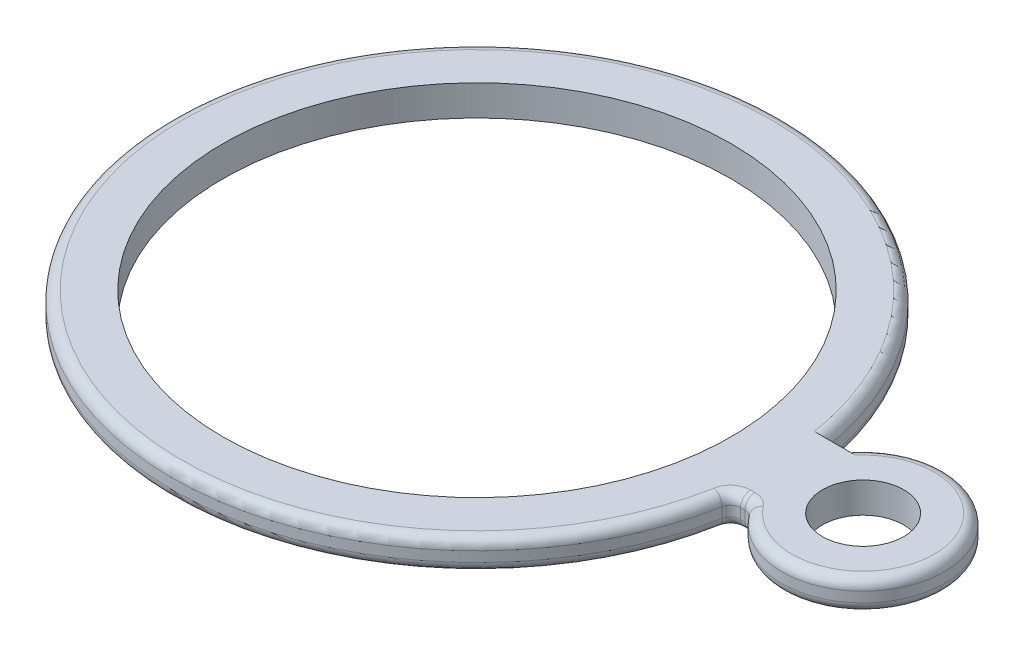
ISO-10303-21;
HEADER;
FILE_DESCRIPTION(('STEP AP214'),'2;1');
FILE_NAME('part.step','',(''),(''),'','','');
FILE_SCHEMA(('AUTOMOTIVE_DESIGN { 1 0 10303 214 1 1 1 1 }'));
ENDSEC;
DATA;
#1=APPLICATION_CONTEXT('core data for automotive mechanical design processes');
#2=APPLICATION_PROTOCOL_DEFINITION('international standard','automotive_design',2000,#1);
#3=PRODUCT_CONTEXT('',#1,'mechanical');
#4=PRODUCT('Part','Part','',(#3));
#5=PRODUCT_RELATED_PRODUCT_CATEGORY('part','',(#4));
#6=PRODUCT_DEFINITION_FORMATION('','',#4);
#7=PRODUCT_DEFINITION_CONTEXT('part definition',#1,'design');
#8=PRODUCT_DEFINITION('design','',#6,#7);
#9=PRODUCT_DEFINITION_SHAPE('','',#8);
#10=(LENGTH_UNIT() NAMED_UNIT(*) SI_UNIT(.MILLI.,.METRE.));
#11=(NAMED_UNIT(*) PLANE_ANGLE_UNIT() SI_UNIT($,.RADIAN.));
#12=(NAMED_UNIT(*) SI_UNIT($,.STERADIAN.) SOLID_ANGLE_UNIT());
#13=UNCERTAINTY_MEASURE_WITH_UNIT(LENGTH_MEASURE(1.E-05),#10,'distance_accuracy_value','');
#14=(GEOMETRIC_REPRESENTATION_CONTEXT(3) GLOBAL_UNCERTAINTY_ASSIGNED_CONTEXT((#13)) GLOBAL_UNIT_ASSIGNED_CONTEXT((#10,
#11,#12)) REPRESENTATION_CONTEXT('',''));
#15=CARTESIAN_POINT('',(0.,0.,0.));
#16=DIRECTION('',(0.,0.,1.));
#17=DIRECTION('',(1.,0.,0.));
#18=AXIS2_PLACEMENT_3D('',#15,#16,#17);
#19=CARTESIAN_POINT('',(0.,3.,0.));
#20=DIRECTION('',(0.,-1.,0.));
#21=DIRECTION('',(0.,0.,-1.));
#22=AXIS2_PLACEMENT_3D('',#19,#20,#21);
#23=CYLINDRICAL_SURFACE('',#22,30.);
#24=DIRECTION('',(0.,-1.,0.));
#25=VECTOR('',#24,1.);
#26=CARTESIAN_POINT('',(29.5132295758515,3.,5.3823117712637));
#27=LINE('',#26,#25);
#28=CARTESIAN_POINT('',(29.5132295758515,1.,5.3823117712637));
#29=VERTEX_POINT('',#28);
#30=CARTESIAN_POINT('',(29.5132295758515,2.,5.3823117712637));
#31=VERTEX_POINT('',#30);
#32=EDGE_CURVE('E193',#29,#31,#27,.F.);
#33=ORIENTED_EDGE('',*,*,#32,.T.);
#34=CARTESIAN_POINT('',(0.,2.,0.));
#35=DIRECTION('',(0.,1.,0.));
#36=DIRECTION('',(0.,0.,1.));
#37=AXIS2_PLACEMENT_3D('',#34,#35,#36);
#38=CIRCLE('',#37,30.);
#39=CARTESIAN_POINT('',(29.6511499085915,2.,-4.56172216363916));
#40=VERTEX_POINT('',#39);
#41=EDGE_CURVE('E197',#31,#40,#38,.F.);
#42=ORIENTED_EDGE('',*,*,#41,.T.);
#43=DIRECTION('',(0.,-1.,0.));
#44=VECTOR('',#43,1.);
#45=CARTESIAN_POINT('',(29.6511499085915,3.,-4.56172216363916));
#46=LINE('',#45,#44);
#47=CARTESIAN_POINT('',(29.6511499085915,1.,-4.56172216363916));
#48=VERTEX_POINT('',#47);
#49=EDGE_CURVE('E182',#40,#48,#46,.T.);
#50=ORIENTED_EDGE('',*,*,#49,.T.);
#51=CARTESIAN_POINT('',(0.,1.,0.));
#52=DIRECTION('',(0.,1.,0.));
#53=DIRECTION('',(0.,0.,1.));
#54=AXIS2_PLACEMENT_3D('',#51,#52,#53);
#55=CIRCLE('',#54,30.);
#56=EDGE_CURVE('E195',#48,#29,#55,.T.);
#57=ORIENTED_EDGE('',*,*,#56,.T.);
#58=EDGE_LOOP('',(#33,#42,#50,#57));
#59=FACE_BOUND('',#58,.T.);
#60=ADVANCED_FACE('F35',(#59),#23,.T.);
#61=CARTESIAN_POINT('',(0.,3.,4.56172216363916));
#62=DIRECTION('',(0.,0.,-1.));
#63=DIRECTION('',(-1.,0.,0.));
#64=AXIS2_PLACEMENT_3D('',#61,#62,#63);
#65=PLANE('',#64);
#66=DIRECTION('',(1.,0.,0.));
#67=VECTOR('',#66,1.);
#68=CARTESIAN_POINT('',(29.6511499085915,2.,4.56172216363916));
#69=LINE('',#68,#67);
#70=CARTESIAN_POINT('',(30.9241787349817,2.,4.56172216363916));
#71=VERTEX_POINT('',#70);
#72=CARTESIAN_POINT('',(30.4970038950466,2.,4.56172216363916));
#73=VERTEX_POINT('',#72);
#74=EDGE_CURVE('E53',#71,#73,#69,.F.);
#75=ORIENTED_EDGE('',*,*,#74,.T.);
#76=DIRECTION('',(0.,1.,0.));
#77=VECTOR('',#76,1.);
#78=CARTESIAN_POINT('',(30.4970038950466,0.,4.56172216363916));
#79=LINE('',#78,#77);
#80=CARTESIAN_POINT('',(30.4970038950466,1.,4.56172216363916));
#81=VERTEX_POINT('',#80);
#82=EDGE_CURVE('E220',#73,#81,#79,.F.);
#83=ORIENTED_EDGE('',*,*,#82,.T.);
#84=DIRECTION('',(1.,0.,0.));
#85=VECTOR('',#84,1.);
#86=CARTESIAN_POINT('',(0.,1.,4.56172216363916));
#87=LINE('',#86,#85);
#88=CARTESIAN_POINT('',(30.9241787349817,1.,4.56172216363916));
#89=VERTEX_POINT('',#88);
#90=EDGE_CURVE('E216',#81,#89,#87,.T.);
#91=ORIENTED_EDGE('',*,*,#90,.T.);
#92=DIRECTION('',(0.,1.,0.));
#93=VECTOR('',#92,1.);
#94=CARTESIAN_POINT('',(30.9241787349817,3.,4.56172216363916));
#95=LINE('',#94,#93);
#96=EDGE_CURVE('E58',#89,#71,#95,.T.);
#97=ORIENTED_EDGE('',*,*,#96,.T.);
#98=EDGE_LOOP('',(#75,#83,#91,#97));
#99=FACE_BOUND('',#98,.T.);
#100=ADVANCED_FACE('F279',(#99),#65,.F.);
#101=CARTESIAN_POINT('',(38.,3.,0.));
#102=DIRECTION('',(0.,-1.,0.));
#103=DIRECTION('',(0.,0.,-1.));
#104=AXIS2_PLACEMENT_3D('',#101,#102,#103);
#105=CYLINDRICAL_SURFACE('',#104,8.);
#106=DIRECTION('',(0.,-1.,0.));
#107=VECTOR('',#106,1.);
#108=CARTESIAN_POINT('',(31.428037515189,3.,-4.56172216363916));
#109=LINE('',#108,#107);
#110=CARTESIAN_POINT('',(31.428037515189,2.,-4.56172216363916));
#111=VERTEX_POINT('',#110);
#112=CARTESIAN_POINT('',(31.428037515189,1.,-4.56172216363916));
#113=VERTEX_POINT('',#112);
#114=EDGE_CURVE('E139',#111,#113,#109,.T.);
#115=ORIENTED_EDGE('',*,*,#114,.F.);
#116=CARTESIAN_POINT('',(38.,2.,0.));
#117=DIRECTION('',(0.,1.,0.));
#118=DIRECTION('',(0.,0.,1.));
#119=AXIS2_PLACEMENT_3D('',#116,#117,#118);
#120=CIRCLE('',#119,8.);
#121=CARTESIAN_POINT('',(31.7103810977615,2.,4.94375303434592));
#122=VERTEX_POINT('',#121);
#123=EDGE_CURVE('E214',#111,#122,#120,.F.);
#124=ORIENTED_EDGE('',*,*,#123,.T.);
#125=DIRECTION('',(0.,-1.,0.));
#126=VECTOR('',#125,1.);
#127=CARTESIAN_POINT('',(31.7103810977615,3.,4.94375303434592));
#128=LINE('',#127,#126);
#129=CARTESIAN_POINT('',(31.7103810977615,1.,4.94375303434592));
#130=VERTEX_POINT('',#129);
#131=EDGE_CURVE('E210',#122,#130,#128,.T.);
#132=ORIENTED_EDGE('',*,*,#131,.T.);
#133=CARTESIAN_POINT('',(38.,1.,0.));
#134=DIRECTION('',(0.,1.,0.));
#135=DIRECTION('',(0.,0.,1.));
#136=AXIS2_PLACEMENT_3D('',#133,#134,#135);
#137=CIRCLE('',#136,8.);
#138=EDGE_CURVE('E212',#130,#113,#137,.T.);
#139=ORIENTED_EDGE('',*,*,#138,.T.);
#140=EDGE_LOOP('',(#115,#124,#132,#139));
#141=FACE_BOUND('',#140,.T.);
#142=ADVANCED_FACE('F251',(#141),#105,.T.);
#143=CARTESIAN_POINT('',(0.,3.,0.));
#144=DIRECTION('',(0.,-1.,0.));
#145=DIRECTION('',(0.,0.,-1.));
#146=AXIS2_PLACEMENT_3D('',#143,#144,#145);
#147=CYLINDRICAL_SURFACE('',#146,25.);
#148=CARTESIAN_POINT('',(0.,3.,0.));
#149=DIRECTION('',(0.,1.,0.));
#150=DIRECTION('',(0.,0.,1.));
#151=AXIS2_PLACEMENT_3D('',#148,#149,#150);
#152=CIRCLE('',#151,25.);
#153=CARTESIAN_POINT('',(0.,3.,25.));
#154=VERTEX_POINT('',#153);
#155=EDGE_CURVE('E426',#154,#154,#152,.T.);
#156=ORIENTED_EDGE('',*,*,#155,.T.);
#157=EDGE_LOOP('',(#156));
#158=FACE_BOUND('',#157,.T.);
#159=CARTESIAN_POINT('',(0.,0.,0.));
#160=DIRECTION('',(0.,1.,0.));
#161=DIRECTION('',(0.,0.,1.));
#162=AXIS2_PLACEMENT_3D('',#159,#160,#161);
#163=CIRCLE('',#162,25.);
#164=CARTESIAN_POINT('',(0.,0.,25.));
#165=VERTEX_POINT('',#164);
#166=EDGE_CURVE('E168',#165,#165,#163,.T.);
#167=ORIENTED_EDGE('',*,*,#166,.F.);
#168=EDGE_LOOP('',(#167));
#169=FACE_BOUND('',#168,.T.);
#170=ADVANCED_FACE('F248',(#158,#169),#147,.F.);
#171=CARTESIAN_POINT('',(0.,3.,-4.56172216363916));
#172=DIRECTION('',(0.,0.,-1.));
#173=DIRECTION('',(-1.,0.,0.));
#174=AXIS2_PLACEMENT_3D('',#171,#172,#173);
#175=PLANE('',#174);
#176=DIRECTION('',(1.,0.,0.));
#177=VECTOR('',#176,1.);
#178=CARTESIAN_POINT('',(0.,0.,-4.56172216363916));
#179=LINE('',#178,#177);
#180=CARTESIAN_POINT('',(28.6389715405732,0.,-4.56172216363916));
#181=VERTEX_POINT('',#180);
#182=CARTESIAN_POINT('',(32.6905093557138,0.,-4.56172216363916));
#183=VERTEX_POINT('',#182);
#184=EDGE_CURVE('E164',#181,#183,#179,.T.);
#185=ORIENTED_EDGE('',*,*,#184,.F.);
#186=CARTESIAN_POINT('',(28.6389715405732,0.,-4.56172216363916));
#187=CARTESIAN_POINT('',(28.6964328075229,-4.55510179670688E-05,-4.56172216363916));
#188=CARTESIAN_POINT('',(28.7538845778944,0.00482756519208188,-4.56172216363916));
#189=CARTESIAN_POINT('',(28.8671486516525,0.0240852129021317,-4.56172216363916));
#190=CARTESIAN_POINT('',(28.9229616110344,0.038465882909663,-4.56172216363916));
#191=CARTESIAN_POINT('',(29.0314104884211,0.0764249878051002,-4.56172216363916));
#192=CARTESIAN_POINT('',(29.0840444121535,0.10000912841061,-4.56172216363916));
#193=CARTESIAN_POINT('',(29.1845597541203,0.155722746068513,-4.56172216363916));
#194=CARTESIAN_POINT('',(29.2324425277727,0.187849776307178,-4.56172216363916));
#195=CARTESIAN_POINT('',(29.3217842791457,0.259556471933176,-4.56172216363916));
#196=CARTESIAN_POINT('',(29.36328028255,0.299089987846407,-4.56172216363916));
#197=CARTESIAN_POINT('',(29.438960770142,0.384645486723418,-4.56172216363916));
#198=CARTESIAN_POINT('',(29.4731439946626,0.430668585292413,-4.56172216363916));
#199=CARTESIAN_POINT('',(29.5328006308723,0.527322351135234,-4.56172216363916));
#200=CARTESIAN_POINT('',(29.5583684869613,0.577894799683099,-4.56172216363916));
#201=CARTESIAN_POINT('',(29.6005332524671,0.682632366302645,-4.56172216363916));
#202=CARTESIAN_POINT('',(29.6171369388897,0.736794735475624,-4.56172216363916));
#203=CARTESIAN_POINT('',(29.6363673626402,0.826124464892985,-4.56172216363916));
#204=CARTESIAN_POINT('',(29.6419076185208,0.860691323328164,-4.56172216363916));
#205=CARTESIAN_POINT('',(29.6492980369049,0.930166880125294,-4.56172216363916));
#206=CARTESIAN_POINT('',(29.6511534942957,0.965075015443822,-4.56172216363916));
#207=CARTESIAN_POINT('',(29.6511499085915,1.,-4.56172216363916));
#208=B_SPLINE_CURVE_WITH_KNOTS('',3,(#186,#187,#188,#189,#190,#191,#192,#193,#194,#195,#196,
#197,#198,#199,#200,#201,#202,#203,#204,#205,#206,#207),.UNSPECIFIED.,.F.,.F.,(4,2,2,2,2,2,2,2,
2,2,4),(0.,0.172164747896742,0.344259614011329,0.516461340753014,0.688613799322514,
0.859727258187154,1.03087016861033,1.20007078835339,1.3691433108975,1.47398689604088,
1.57867971640918),.UNSPECIFIED.);
#209=EDGE_CURVE('E231',#181,#48,#208,.T.);
#210=ORIENTED_EDGE('',*,*,#209,.T.);
#211=ORIENTED_EDGE('',*,*,#49,.F.);
#212=CARTESIAN_POINT('',(29.6511499085915,2.,-4.56172216363916));
#213=CARTESIAN_POINT('',(29.6511498894436,2.02789484300134,-4.56172216363916));
#214=CARTESIAN_POINT('',(29.6499682378599,2.05577624136621,-4.56172216363916));
#215=CARTESIAN_POINT('',(29.645255284375,2.11133774042069,-4.56172216363916));
#216=CARTESIAN_POINT('',(29.6417241482003,2.13901785516908,-4.56172216363916));
#217=CARTESIAN_POINT('',(29.6276451695433,2.22139243707681,-4.56172216363916));
#218=CARTESIAN_POINT('',(29.6136116323102,2.27553224261742,-4.56172216363916));
#219=CARTESIAN_POINT('',(29.576664431473,2.38068121473864,-4.56172216363916));
#220=CARTESIAN_POINT('',(29.5537474848748,2.43168921583259,-4.56172216363916));
#221=CARTESIAN_POINT('',(29.4997178856042,2.5291618156753,-4.56172216363916));
#222=CARTESIAN_POINT('',(29.4686059360899,2.5756268037607,-4.56172216363916));
#223=CARTESIAN_POINT('',(29.3989238263734,2.66295626432184,-4.56172216363916));
#224=CARTESIAN_POINT('',(29.360317257298,2.70379166115939,-4.56172216363916));
#225=CARTESIAN_POINT('',(29.2768554758536,2.77849521243116,-4.56172216363916));
#226=CARTESIAN_POINT('',(29.2319989373799,2.81236188446963,-4.56172216363916));
#227=CARTESIAN_POINT('',(29.1367854631797,2.87256299902535,-4.56172216363916));
#228=CARTESIAN_POINT('',(29.0863724566466,2.89880866047738,-4.56172216363916));
#229=CARTESIAN_POINT('',(28.9818962593331,2.94255912820593,-4.56172216363916));
#230=CARTESIAN_POINT('',(28.9278345701572,2.96006750568296,-4.56172216363916));
#231=CARTESIAN_POINT('',(28.834424610554,2.9819632081696,-4.56172216363916));
#232=CARTESIAN_POINT('',(28.7956149284715,2.98872334815358,-4.56172216363916));
#233=CARTESIAN_POINT('',(28.717532115619,2.99774146814459,-4.56172216363916));
#234=CARTESIAN_POINT('',(28.6782597245563,3.0000058537892,-4.56172216363916));
#235=CARTESIAN_POINT('',(28.6389715405732,3.,-4.56172216363916));
#236=B_SPLINE_CURVE_WITH_KNOTS('',3,(#212,#213,#214,#215,#216,#217,#218,#219,#220,#221,#222,
#223,#224,#225,#226,#227,#228,#229,#230,#231,#232,#233,#234,#235),.UNSPECIFIED.,.F.,.F.,(4,2,2,
2,2,2,2,2,2,2,2,4),(0.,0.0836328495791446,0.167259800547139,0.334184665223513,0.501171278332986,
0.668143568107361,0.835948280900832,1.00378865250293,1.1735123151024,1.34316654941164,
1.46110326311434,1.57887181737315),.UNSPECIFIED.);
#237=CARTESIAN_POINT('',(28.6389715405732,3.,-4.56172216363916));
#238=VERTEX_POINT('',#237);
#239=EDGE_CURVE('E222',#40,#238,#236,.T.);
#240=ORIENTED_EDGE('',*,*,#239,.T.);
#241=DIRECTION('',(1.,0.,0.));
#242=VECTOR('',#241,1.);
#243=CARTESIAN_POINT('',(0.,3.,-4.56172216363916));
#244=LINE('',#243,#242);
#245=CARTESIAN_POINT('',(32.6905093557138,3.,-4.56172216363916));
#246=VERTEX_POINT('',#245);
#247=EDGE_CURVE('E181',#238,#246,#244,.T.);
#248=ORIENTED_EDGE('',*,*,#247,.T.);
#249=CARTESIAN_POINT('',(32.6905093557138,3.,-4.56172216363916));
#250=CARTESIAN_POINT('',(32.6062895909377,2.99999226976471,-4.56172216363916));
#251=CARTESIAN_POINT('',(32.5218199849481,2.9938694477852,-4.56172216363916));
#252=CARTESIAN_POINT('',(32.3542842919586,2.96838243353989,-4.56172216363916));
#253=CARTESIAN_POINT('',(32.271233579335,2.94891880046482,-4.56172216363916));
#254=CARTESIAN_POINT('',(32.124024199513,2.9004033311119,-4.56172216363916));
#255=CARTESIAN_POINT('',(32.0591171728084,2.87364836321297,-4.56172216363916));
#256=CARTESIAN_POINT('',(31.934588817064,2.81006589663255,-4.56172216363916));
#257=CARTESIAN_POINT('',(31.8749515744507,2.77327019805864,-4.56172216363916));
#258=CARTESIAN_POINT('',(31.7732274843745,2.69695575281444,-4.56172216363916));
#259=CARTESIAN_POINT('',(31.7299061341197,2.65908720454119,-4.56172216363916));
#260=CARTESIAN_POINT('',(31.6500164590252,2.57669576233968,-4.56172216363916));
#261=CARTESIAN_POINT('',(31.6134499665493,2.53217106873383,-4.56172216363916));
#262=CARTESIAN_POINT('',(31.5486420430787,2.43684231395269,-4.56172216363916));
#263=CARTESIAN_POINT('',(31.5204708271419,2.38599007261506,-4.56172216363916));
#264=CARTESIAN_POINT('',(31.4746899001138,2.2797662090897,-4.56172216363916));
#265=CARTESIAN_POINT('',(31.4570571840414,2.22440473296227,-4.56172216363916));
#266=CARTESIAN_POINT('',(31.4395919769499,2.14028446304133,-4.56172216363916));
#267=CARTESIAN_POINT('',(31.435267941393,2.11240063949711,-4.56172216363916));
#268=CARTESIAN_POINT('',(31.4294897887883,2.05635143766009,-4.56172216363916));
#269=CARTESIAN_POINT('',(31.4280342685707,2.02818620380286,-4.56172216363916));
#270=CARTESIAN_POINT('',(31.428037515189,2.,-4.56172216363916));
#271=B_SPLINE_CURVE_WITH_KNOTS('',3,(#249,#250,#251,#252,#253,#254,#255,#256,#257,#258,#259,
#260,#261,#262,#263,#264,#265,#266,#267,#268,#269,#270),.UNSPECIFIED.,.F.,.F.,(4,2,2,2,2,2,2,2,
2,2,4),(0.,0.252844612339547,0.507594691786583,0.717409020923558,0.926566406429637,
1.09849825985415,1.27047668428913,1.44385551775163,1.61685447886156,1.70137660043909,
1.78585736670053),.UNSPECIFIED.);
#272=EDGE_CURVE('E45',#246,#111,#271,.T.);
#273=ORIENTED_EDGE('',*,*,#272,.T.);
#274=ORIENTED_EDGE('',*,*,#114,.T.);
#275=CARTESIAN_POINT('',(31.428037515189,1.,-4.56172216363916));
#276=CARTESIAN_POINT('',(31.4280354834646,0.975571890815246,-4.56172216363916));
#277=CARTESIAN_POINT('',(31.4291279741013,0.951156885585626,-4.56172216363916));
#278=CARTESIAN_POINT('',(31.4334712243956,0.902528919942106,-4.56172216363916));
#279=CARTESIAN_POINT('',(31.4367211476929,0.878315884913179,-4.56172216363916));
#280=CARTESIAN_POINT('',(31.4496120548973,0.806494346106857,-4.56172216363916));
#281=CARTESIAN_POINT('',(31.4623950017396,0.759415565707707,-4.56172216363916));
#282=CARTESIAN_POINT('',(31.4956529751019,0.668171427016443,-4.56172216363916));
#283=CARTESIAN_POINT('',(31.5161195657148,0.624002935793809,-4.56172216363916));
#284=CARTESIAN_POINT('',(31.5637905943043,0.539435323140324,-4.56172216363916));
#285=CARTESIAN_POINT('',(31.5910016509261,0.499039958384092,-4.56172216363916));
#286=CARTESIAN_POINT('',(31.6528001494588,0.420509078008099,-4.56172216363916));
#287=CARTESIAN_POINT('',(31.6877230409126,0.382639139819652,-4.56172216363916));
#288=CARTESIAN_POINT('',(31.7626077999865,0.312296821553733,-4.56172216363916));
#289=CARTESIAN_POINT('',(31.8025712011039,0.279826091101153,-4.56172216363916));
#290=CARTESIAN_POINT('',(31.8933577697163,0.215476782843884,-4.56172216363916));
#291=CARTESIAN_POINT('',(31.9448825754451,0.184590563940882,-4.56172216363916));
#292=CARTESIAN_POINT('',(32.0517028274212,0.130227708995505,-4.56172216363916));
#293=CARTESIAN_POINT('',(32.1070014996336,0.10675751125781,-4.56172216363916));
#294=CARTESIAN_POINT('',(32.2316552148331,0.0629118131695709,-4.56172216363916));
#295=CARTESIAN_POINT('',(32.301575074661,0.04414641102573,-4.56172216363916));
#296=CARTESIAN_POINT('',(32.4432549922371,0.0164242541743296,-4.56172216363916));
#297=CARTESIAN_POINT('',(32.5150141125552,0.00746260059689091,-4.56172216363916));
#298=CARTESIAN_POINT('',(32.6214839386785,0.00102815264610975,-4.56172216363916));
#299=CARTESIAN_POINT('',(32.6560067301101,1.5530003590166E-06,-4.56172216363916));
#300=CARTESIAN_POINT('',(32.6905093557138,0.,-4.56172216363916));
#301=B_SPLINE_CURVE_WITH_KNOTS('',3,(#275,#276,#277,#278,#279,#280,#281,#282,#283,#284,#285,
#286,#287,#288,#289,#290,#291,#292,#293,#294,#295,#296,#297,#298,#299,#300),.UNSPECIFIED.,.F.,
.F.,(4,2,2,2,2,2,2,2,2,2,2,2,4),(0.,0.0732345145535105,0.14644065524098,0.292001513328647,
0.437403024647555,0.582947793857446,0.736905128457831,0.890909415694596,1.07046890806992,
1.25018386149541,1.46658965092193,1.68288725430857,1.78642635641483),.UNSPECIFIED.);
#302=EDGE_CURVE('E11',#113,#183,#301,.T.);
#303=ORIENTED_EDGE('',*,*,#302,.T.);
#304=EDGE_LOOP('',(#185,#210,#211,#240,#248,#273,#274,#303));
#305=FACE_BOUND('',#304,.T.);
#306=ADVANCED_FACE('F242',(#305),#175,.T.);
#307=CARTESIAN_POINT('',(38.,3.,0.));
#308=DIRECTION('',(0.,-1.,0.));
#309=DIRECTION('',(0.,0.,-1.));
#310=AXIS2_PLACEMENT_3D('',#307,#308,#309);
#311=CYLINDRICAL_SURFACE('',#310,4.00000000000001);
#312=CARTESIAN_POINT('',(38.,3.,0.));
#313=DIRECTION('',(0.,1.,0.));
#314=DIRECTION('',(0.,0.,1.));
#315=AXIS2_PLACEMENT_3D('',#312,#313,#314);
#316=CIRCLE('',#315,4.00000000000001);
#317=CARTESIAN_POINT('',(38.,3.,4.00000000000001));
#318=VERTEX_POINT('',#317);
#319=EDGE_CURVE('E176',#318,#318,#316,.T.);
#320=ORIENTED_EDGE('',*,*,#319,.T.);
#321=EDGE_LOOP('',(#320));
#322=FACE_BOUND('',#321,.T.);
#323=CARTESIAN_POINT('',(38.,0.,0.));
#324=DIRECTION('',(0.,1.,0.));
#325=DIRECTION('',(0.,0.,1.));
#326=AXIS2_PLACEMENT_3D('',#323,#324,#325);
#327=CIRCLE('',#326,4.00000000000001);
#328=CARTESIAN_POINT('',(38.,0.,4.00000000000001));
#329=VERTEX_POINT('',#328);
#330=EDGE_CURVE('E173',#329,#329,#327,.T.);
#331=ORIENTED_EDGE('',*,*,#330,.F.);
#332=EDGE_LOOP('',(#331));
#333=FACE_BOUND('',#332,.T.);
#334=ADVANCED_FACE('F247',(#322,#333),#311,.F.);
#335=CARTESIAN_POINT('',(0.,3.,0.));
#336=DIRECTION('',(0.,1.,0.));
#337=DIRECTION('',(0.,0.,1.));
#338=AXIS2_PLACEMENT_3D('',#335,#336,#337);
#339=PLANE('',#338);
#340=ORIENTED_EDGE('',*,*,#247,.F.);
#341=CARTESIAN_POINT('',(0.,3.,0.));
#342=DIRECTION('',(0.,1.,0.));
#343=DIRECTION('',(0.,0.,1.));
#344=AXIS2_PLACEMENT_3D('',#341,#342,#343);
#345=CIRCLE('',#344,29.);
#346=CARTESIAN_POINT('',(28.5294552566565,3.,5.20290137888825));
#347=VERTEX_POINT('',#346);
#348=EDGE_CURVE('E190',#238,#347,#345,.T.);
#349=ORIENTED_EDGE('',*,*,#348,.T.);
#350=CARTESIAN_POINT('',(30.4970038950466,3.,5.56172216363916));
#351=DIRECTION('',(0.,1.,0.));
#352=DIRECTION('',(0.,0.,1.));
#353=AXIS2_PLACEMENT_3D('',#350,#351,#352);
#354=CIRCLE('',#353,2.);
#355=CARTESIAN_POINT('',(30.4970038950466,3.,3.56172216363916));
#356=VERTEX_POINT('',#355);
#357=EDGE_CURVE('E147',#356,#347,#354,.T.);
#358=ORIENTED_EDGE('',*,*,#357,.F.);
#359=DIRECTION('',(1.,0.,0.));
#360=VECTOR('',#359,1.);
#361=CARTESIAN_POINT('',(31.428037515189,3.,3.56172216363916));
#362=LINE('',#361,#360);
#363=CARTESIAN_POINT('',(30.9241787349817,3.,3.56172216363916));
#364=VERTEX_POINT('',#363);
#365=EDGE_CURVE('E134',#356,#364,#362,.T.);
#366=ORIENTED_EDGE('',*,*,#365,.T.);
#367=CARTESIAN_POINT('',(30.9241787349817,3.,5.56172216363916));
#368=DIRECTION('',(0.,1.,0.));
#369=DIRECTION('',(0.,0.,1.));
#370=AXIS2_PLACEMENT_3D('',#367,#368,#369);
#371=CIRCLE('',#370,2.);
#372=CARTESIAN_POINT('',(32.4965834605413,3.,4.32578390505268));
#373=VERTEX_POINT('',#372);
#374=EDGE_CURVE('E127',#373,#364,#371,.T.);
#375=ORIENTED_EDGE('',*,*,#374,.F.);
#376=CARTESIAN_POINT('',(38.,3.,0.));
#377=DIRECTION('',(0.,1.,0.));
#378=DIRECTION('',(0.,0.,1.));
#379=AXIS2_PLACEMENT_3D('',#376,#377,#378);
#380=CIRCLE('',#379,7.);
#381=EDGE_CURVE('E131',#373,#246,#380,.T.);
#382=ORIENTED_EDGE('',*,*,#381,.T.);
#383=EDGE_LOOP('',(#340,#349,#358,#366,#375,#382));
#384=FACE_BOUND('',#383,.T.);
#385=ORIENTED_EDGE('',*,*,#155,.F.);
#386=EDGE_LOOP('',(#385));
#387=FACE_BOUND('',#386,.T.);
#388=ORIENTED_EDGE('',*,*,#319,.F.);
#389=EDGE_LOOP('',(#388));
#390=FACE_BOUND('',#389,.T.);
#391=ADVANCED_FACE('F129',(#384,#387,#390),#339,.T.);
#392=CARTESIAN_POINT('',(0.,0.,0.));
#393=DIRECTION('',(0.,1.,0.));
#394=DIRECTION('',(0.,0.,1.));
#395=AXIS2_PLACEMENT_3D('',#392,#393,#394);
#396=PLANE('',#395);
#397=CARTESIAN_POINT('',(0.,0.,0.));
#398=DIRECTION('',(0.,1.,0.));
#399=DIRECTION('',(0.,0.,1.));
#400=AXIS2_PLACEMENT_3D('',#397,#398,#399);
#401=CIRCLE('',#400,29.);
#402=CARTESIAN_POINT('',(28.5294552566565,0.,5.20290137888825));
#403=VERTEX_POINT('',#402);
#404=EDGE_CURVE('E208',#403,#181,#401,.F.);
#405=ORIENTED_EDGE('',*,*,#404,.T.);
#406=ORIENTED_EDGE('',*,*,#184,.T.);
#407=CARTESIAN_POINT('',(38.,0.,0.));
#408=DIRECTION('',(0.,1.,0.));
#409=DIRECTION('',(0.,0.,1.));
#410=AXIS2_PLACEMENT_3D('',#407,#408,#409);
#411=CIRCLE('',#410,7.);
#412=CARTESIAN_POINT('',(32.4965834605413,0.,4.32578390505268));
#413=VERTEX_POINT('',#412);
#414=EDGE_CURVE('E206',#183,#413,#411,.F.);
#415=ORIENTED_EDGE('',*,*,#414,.T.);
#416=CARTESIAN_POINT('',(30.9241787349817,0.,5.56172216363916));
#417=DIRECTION('',(0.,1.,0.));
#418=DIRECTION('',(0.,0.,1.));
#419=AXIS2_PLACEMENT_3D('',#416,#417,#418);
#420=CIRCLE('',#419,2.);
#421=CARTESIAN_POINT('',(30.9241787349817,0.,3.56172216363916));
#422=VERTEX_POINT('',#421);
#423=EDGE_CURVE('E204',#422,#413,#420,.F.);
#424=ORIENTED_EDGE('',*,*,#423,.F.);
#425=DIRECTION('',(1.,0.,0.));
#426=VECTOR('',#425,1.);
#427=CARTESIAN_POINT('',(0.,0.,3.56172216363916));
#428=LINE('',#427,#426);
#429=CARTESIAN_POINT('',(30.4970038950466,0.,3.56172216363916));
#430=VERTEX_POINT('',#429);
#431=EDGE_CURVE('E202',#422,#430,#428,.F.);
#432=ORIENTED_EDGE('',*,*,#431,.T.);
#433=CARTESIAN_POINT('',(30.4970038950466,0.,5.56172216363916));
#434=DIRECTION('',(0.,1.,0.));
#435=DIRECTION('',(0.,0.,1.));
#436=AXIS2_PLACEMENT_3D('',#433,#434,#435);
#437=CIRCLE('',#436,2.);
#438=EDGE_CURVE('E199',#403,#430,#437,.F.);
#439=ORIENTED_EDGE('',*,*,#438,.F.);
#440=EDGE_LOOP('',(#405,#406,#415,#424,#432,#439));
#441=FACE_BOUND('',#440,.T.);
#442=ORIENTED_EDGE('',*,*,#166,.T.);
#443=EDGE_LOOP('',(#442));
#444=FACE_BOUND('',#443,.T.);
#445=ORIENTED_EDGE('',*,*,#330,.T.);
#446=EDGE_LOOP('',(#445));
#447=FACE_BOUND('',#446,.T.);
#448=ADVANCED_FACE('F276',(#441,#444,#447),#396,.F.);
#449=CARTESIAN_POINT('',(38.,1.,0.));
#450=DIRECTION('',(0.,1.,0.));
#451=DIRECTION('',(0.,0.,1.));
#452=AXIS2_PLACEMENT_3D('',#449,#450,#451);
#453=TOROIDAL_SURFACE('',#452,7.,1.);
#454=CARTESIAN_POINT('',(32.4965834605413,1.,4.32578390505268));
#455=DIRECTION('',(-0.617969129293238,0.,-0.786202362779811));
#456=DIRECTION('',(-0.786202362779811,0.,0.617969129293238));
#457=AXIS2_PLACEMENT_3D('',#454,#455,#456);
#458=CIRCLE('',#457,1.);
#459=EDGE_CURVE('E40',#413,#130,#458,.T.);
#460=ORIENTED_EDGE('',*,*,#459,.F.);
#461=ORIENTED_EDGE('',*,*,#414,.F.);
#462=ORIENTED_EDGE('',*,*,#302,.F.);
#463=ORIENTED_EDGE('',*,*,#138,.F.);
#464=EDGE_LOOP('',(#460,#461,#462,#463));
#465=FACE_BOUND('',#464,.T.);
#466=ADVANCED_FACE('F37',(#465),#453,.T.);
#467=CARTESIAN_POINT('',(30.9241787349817,1.,5.56172216363916));
#468=DIRECTION('',(0.,1.,0.));
#469=DIRECTION('',(0.,0.,1.));
#470=AXIS2_PLACEMENT_3D('',#467,#468,#469);
#471=TOROIDAL_SURFACE('',#470,2.,1.);
#472=ORIENTED_EDGE('',*,*,#423,.T.);
#473=ORIENTED_EDGE('',*,*,#459,.T.);
#474=CARTESIAN_POINT('',(30.9241787349817,1.,5.56172216363916));
#475=DIRECTION('',(0.,1.,0.));
#476=DIRECTION('',(0.,0.,1.));
#477=AXIS2_PLACEMENT_3D('',#474,#475,#476);
#478=CIRCLE('',#477,1.);
#479=EDGE_CURVE('E154',#89,#130,#478,.F.);
#480=ORIENTED_EDGE('',*,*,#479,.F.);
#481=CARTESIAN_POINT('',(30.9241787349817,1.,3.56172216363916));
#482=DIRECTION('',(1.,0.,0.));
#483=DIRECTION('',(0.,0.,-1.));
#484=AXIS2_PLACEMENT_3D('',#481,#482,#483);
#485=CIRCLE('',#484,1.);
#486=EDGE_CURVE('E151',#422,#89,#485,.F.);
#487=ORIENTED_EDGE('',*,*,#486,.F.);
#488=EDGE_LOOP('',(#472,#473,#480,#487));
#489=FACE_BOUND('',#488,.T.);
#490=ADVANCED_FACE('F270',(#489),#471,.T.);
#491=CARTESIAN_POINT('',(38.,2.,0.));
#492=DIRECTION('',(0.,1.,0.));
#493=DIRECTION('',(0.,0.,1.));
#494=AXIS2_PLACEMENT_3D('',#491,#492,#493);
#495=TOROIDAL_SURFACE('',#494,7.,1.);
#496=ORIENTED_EDGE('',*,*,#272,.F.);
#497=ORIENTED_EDGE('',*,*,#381,.F.);
#498=CARTESIAN_POINT('',(32.4965834605413,2.,4.32578390505268));
#499=DIRECTION('',(-0.617969129293238,0.,-0.786202362779811));
#500=DIRECTION('',(-0.786202362779811,0.,0.617969129293238));
#501=AXIS2_PLACEMENT_3D('',#498,#499,#500);
#502=CIRCLE('',#501,1.);
#503=EDGE_CURVE('E145',#122,#373,#502,.T.);
#504=ORIENTED_EDGE('',*,*,#503,.F.);
#505=ORIENTED_EDGE('',*,*,#123,.F.);
#506=EDGE_LOOP('',(#496,#497,#504,#505));
#507=FACE_BOUND('',#506,.T.);
#508=ADVANCED_FACE('F143',(#507),#495,.T.);
#509=CARTESIAN_POINT('',(30.9241787349817,3.,5.56172216363916));
#510=DIRECTION('',(0.,-1.,0.));
#511=DIRECTION('',(0.,0.,-1.));
#512=AXIS2_PLACEMENT_3D('',#509,#510,#511);
#513=CYLINDRICAL_SURFACE('',#512,1.);
#514=ORIENTED_EDGE('',*,*,#479,.T.);
#515=ORIENTED_EDGE('',*,*,#131,.F.);
#516=CARTESIAN_POINT('',(30.9241787349817,2.,5.56172216363916));
#517=DIRECTION('',(0.,1.,0.));
#518=DIRECTION('',(0.,0.,1.));
#519=AXIS2_PLACEMENT_3D('',#516,#517,#518);
#520=CIRCLE('',#519,1.);
#521=EDGE_CURVE('E150',#71,#122,#520,.F.);
#522=ORIENTED_EDGE('',*,*,#521,.F.);
#523=ORIENTED_EDGE('',*,*,#96,.F.);
#524=EDGE_LOOP('',(#514,#515,#522,#523));
#525=FACE_BOUND('',#524,.T.);
#526=ADVANCED_FACE('F269',(#525),#513,.F.);
#527=CARTESIAN_POINT('',(0.,1.,3.56172216363916));
#528=DIRECTION('',(1.,0.,0.));
#529=DIRECTION('',(0.,0.,-1.));
#530=AXIS2_PLACEMENT_3D('',#527,#528,#529);
#531=CYLINDRICAL_SURFACE('',#530,1.);
#532=ORIENTED_EDGE('',*,*,#486,.T.);
#533=ORIENTED_EDGE('',*,*,#90,.F.);
#534=CARTESIAN_POINT('',(30.4970038950466,1.,3.56172216363916));
#535=DIRECTION('',(-1.,0.,0.));
#536=DIRECTION('',(0.,0.,1.));
#537=AXIS2_PLACEMENT_3D('',#534,#535,#536);
#538=CIRCLE('',#537,1.);
#539=EDGE_CURVE('E156',#430,#81,#538,.T.);
#540=ORIENTED_EDGE('',*,*,#539,.F.);
#541=ORIENTED_EDGE('',*,*,#431,.F.);
#542=EDGE_LOOP('',(#532,#533,#540,#541));
#543=FACE_BOUND('',#542,.T.);
#544=ADVANCED_FACE('F321',(#543),#531,.T.);
#545=CARTESIAN_POINT('',(0.,1.,0.));
#546=DIRECTION('',(0.,1.,0.));
#547=DIRECTION('',(0.,0.,1.));
#548=AXIS2_PLACEMENT_3D('',#545,#546,#547);
#549=TOROIDAL_SURFACE('',#548,29.,1.);
#550=ORIENTED_EDGE('',*,*,#209,.F.);
#551=ORIENTED_EDGE('',*,*,#404,.F.);
#552=CARTESIAN_POINT('',(28.5294552566565,1.,5.20290137888825));
#553=DIRECTION('',(0.179410392375456,0.,-0.983774319195051));
#554=DIRECTION('',(-0.983774319195051,0.,-0.179410392375456));
#555=AXIS2_PLACEMENT_3D('',#552,#553,#554);
#556=CIRCLE('',#555,1.);
#557=EDGE_CURVE('E311',#29,#403,#556,.T.);
#558=ORIENTED_EDGE('',*,*,#557,.F.);
#559=ORIENTED_EDGE('',*,*,#56,.F.);
#560=EDGE_LOOP('',(#550,#551,#558,#559));
#561=FACE_BOUND('',#560,.T.);
#562=ADVANCED_FACE('F335',(#561),#549,.T.);
#563=CARTESIAN_POINT('',(30.9241787349817,2.,5.56172216363916));
#564=DIRECTION('',(0.,1.,0.));
#565=DIRECTION('',(0.,0.,1.));
#566=AXIS2_PLACEMENT_3D('',#563,#564,#565);
#567=TOROIDAL_SURFACE('',#566,2.,1.);
#568=ORIENTED_EDGE('',*,*,#503,.T.);
#569=ORIENTED_EDGE('',*,*,#374,.T.);
#570=CARTESIAN_POINT('',(30.9241787349817,2.,3.56172216363916));
#571=DIRECTION('',(1.,0.,0.));
#572=DIRECTION('',(0.,0.,-1.));
#573=AXIS2_PLACEMENT_3D('',#570,#571,#572);
#574=CIRCLE('',#573,1.);
#575=EDGE_CURVE('E309',#71,#364,#574,.F.);
#576=ORIENTED_EDGE('',*,*,#575,.F.);
#577=ORIENTED_EDGE('',*,*,#521,.T.);
#578=EDGE_LOOP('',(#568,#569,#576,#577));
#579=FACE_BOUND('',#578,.T.);
#580=ADVANCED_FACE('F149',(#579),#567,.T.);
#581=CARTESIAN_POINT('',(30.4970038950466,1.,5.56172216363916));
#582=DIRECTION('',(0.,1.,0.));
#583=DIRECTION('',(0.,0.,1.));
#584=AXIS2_PLACEMENT_3D('',#581,#582,#583);
#585=TOROIDAL_SURFACE('',#584,2.,1.);
#586=ORIENTED_EDGE('',*,*,#438,.T.);
#587=ORIENTED_EDGE('',*,*,#539,.T.);
#588=CARTESIAN_POINT('',(30.4970038950466,1.,5.56172216363916));
#589=DIRECTION('',(0.,1.,0.));
#590=DIRECTION('',(0.,0.,1.));
#591=AXIS2_PLACEMENT_3D('',#588,#589,#590);
#592=CIRCLE('',#591,1.);
#593=EDGE_CURVE('E307',#29,#81,#592,.F.);
#594=ORIENTED_EDGE('',*,*,#593,.F.);
#595=ORIENTED_EDGE('',*,*,#557,.T.);
#596=EDGE_LOOP('',(#586,#587,#594,#595));
#597=FACE_BOUND('',#596,.T.);
#598=ADVANCED_FACE('F318',(#597),#585,.T.);
#599=CARTESIAN_POINT('',(0.,2.,3.56172216363916));
#600=DIRECTION('',(-1.,0.,0.));
#601=DIRECTION('',(0.,0.,1.));
#602=AXIS2_PLACEMENT_3D('',#599,#600,#601);
#603=CYLINDRICAL_SURFACE('',#602,1.);
#604=ORIENTED_EDGE('',*,*,#575,.T.);
#605=ORIENTED_EDGE('',*,*,#365,.F.);
#606=CARTESIAN_POINT('',(30.4970038950466,2.,3.56172216363916));
#607=DIRECTION('',(-1.,0.,0.));
#608=DIRECTION('',(0.,0.,1.));
#609=AXIS2_PLACEMENT_3D('',#606,#607,#608);
#610=CIRCLE('',#609,1.);
#611=EDGE_CURVE('E298',#73,#356,#610,.T.);
#612=ORIENTED_EDGE('',*,*,#611,.F.);
#613=ORIENTED_EDGE('',*,*,#74,.F.);
#614=EDGE_LOOP('',(#604,#605,#612,#613));
#615=FACE_BOUND('',#614,.T.);
#616=ADVANCED_FACE('F324',(#615),#603,.T.);
#617=CARTESIAN_POINT('',(30.4970038950466,3.,5.56172216363916));
#618=DIRECTION('',(0.,-1.,0.));
#619=DIRECTION('',(0.,0.,-1.));
#620=AXIS2_PLACEMENT_3D('',#617,#618,#619);
#621=CYLINDRICAL_SURFACE('',#620,1.);
#622=ORIENTED_EDGE('',*,*,#593,.T.);
#623=ORIENTED_EDGE('',*,*,#82,.F.);
#624=CARTESIAN_POINT('',(30.4970038950466,2.,5.56172216363916));
#625=DIRECTION('',(0.,1.,0.));
#626=DIRECTION('',(0.,0.,1.));
#627=AXIS2_PLACEMENT_3D('',#624,#625,#626);
#628=CIRCLE('',#627,1.);
#629=EDGE_CURVE('E292',#31,#73,#628,.F.);
#630=ORIENTED_EDGE('',*,*,#629,.F.);
#631=ORIENTED_EDGE('',*,*,#32,.F.);
#632=EDGE_LOOP('',(#622,#623,#630,#631));
#633=FACE_BOUND('',#632,.T.);
#634=ADVANCED_FACE('F293',(#633),#621,.F.);
#635=CARTESIAN_POINT('',(30.4970038950466,2.,5.56172216363916));
#636=DIRECTION('',(0.,1.,0.));
#637=DIRECTION('',(0.,0.,1.));
#638=AXIS2_PLACEMENT_3D('',#635,#636,#637);
#639=TOROIDAL_SURFACE('',#638,2.,1.);
#640=ORIENTED_EDGE('',*,*,#611,.T.);
#641=ORIENTED_EDGE('',*,*,#357,.T.);
#642=CARTESIAN_POINT('',(28.5294552566565,2.,5.20290137888825));
#643=DIRECTION('',(0.179410392375456,0.,-0.983774319195051));
#644=DIRECTION('',(-0.983774319195051,0.,-0.179410392375456));
#645=AXIS2_PLACEMENT_3D('',#642,#643,#644);
#646=CIRCLE('',#645,1.);
#647=EDGE_CURVE('E299',#31,#347,#646,.F.);
#648=ORIENTED_EDGE('',*,*,#647,.F.);
#649=ORIENTED_EDGE('',*,*,#629,.T.);
#650=EDGE_LOOP('',(#640,#641,#648,#649));
#651=FACE_BOUND('',#650,.T.);
#652=ADVANCED_FACE('F304',(#651),#639,.T.);
#653=CARTESIAN_POINT('',(0.,2.,0.));
#654=DIRECTION('',(0.,1.,0.));
#655=DIRECTION('',(0.,0.,1.));
#656=AXIS2_PLACEMENT_3D('',#653,#654,#655);
#657=TOROIDAL_SURFACE('',#656,29.,1.);
#658=ORIENTED_EDGE('',*,*,#239,.F.);
#659=ORIENTED_EDGE('',*,*,#41,.F.);
#660=ORIENTED_EDGE('',*,*,#647,.T.);
#661=ORIENTED_EDGE('',*,*,#348,.F.);
#662=EDGE_LOOP('',(#658,#659,#660,#661));
#663=FACE_BOUND('',#662,.T.);
#664=ADVANCED_FACE('F238',(#663),#657,.T.);
#665=CLOSED_SHELL('',(#60,#100,#142,#170,#306,#334,#391,#448,#466,#490,#508,#526,#544,#562,#580,
#598,#616,#634,#652,#664));
#666=MANIFOLD_SOLID_BREP('B2',#665);
#667=ADVANCED_BREP_SHAPE_REPRESENTATION('',(#18,#666),#14);
#668=SHAPE_DEFINITION_REPRESENTATION(#9,#667);
ENDSEC;
END-ISO-10303-21;
